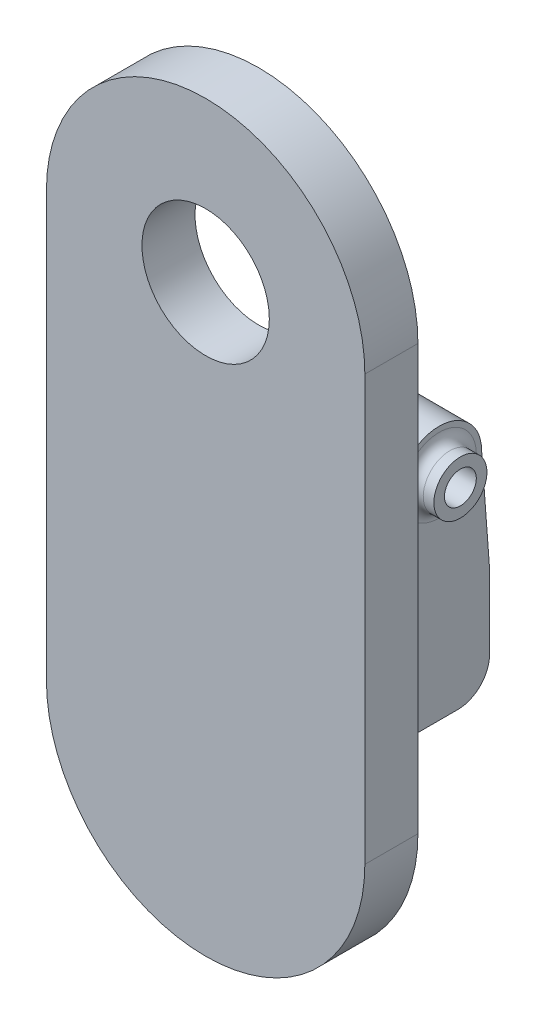
ISO-10303-21;
HEADER;
FILE_DESCRIPTION(('STEP AP214'),'2;1');
FILE_NAME('part.step','',(''),(''),'','','');
FILE_SCHEMA(('AUTOMOTIVE_DESIGN { 1 0 10303 214 1 1 1 1 }'));
ENDSEC;
DATA;
#1=APPLICATION_CONTEXT('core data for automotive mechanical design processes');
#2=APPLICATION_PROTOCOL_DEFINITION('international standard','automotive_design',2000,#1);
#3=PRODUCT_CONTEXT('',#1,'mechanical');
#4=PRODUCT('Part','Part','',(#3));
#5=PRODUCT_RELATED_PRODUCT_CATEGORY('part','',(#4));
#6=PRODUCT_DEFINITION_FORMATION('','',#4);
#7=PRODUCT_DEFINITION_CONTEXT('part definition',#1,'design');
#8=PRODUCT_DEFINITION('design','',#6,#7);
#9=PRODUCT_DEFINITION_SHAPE('','',#8);
#10=(LENGTH_UNIT() NAMED_UNIT(*) SI_UNIT(.MILLI.,.METRE.));
#11=(NAMED_UNIT(*) PLANE_ANGLE_UNIT() SI_UNIT($,.RADIAN.));
#12=(NAMED_UNIT(*) SI_UNIT($,.STERADIAN.) SOLID_ANGLE_UNIT());
#13=UNCERTAINTY_MEASURE_WITH_UNIT(LENGTH_MEASURE(1.E-05),#10,'distance_accuracy_value','');
#14=(GEOMETRIC_REPRESENTATION_CONTEXT(3) GLOBAL_UNCERTAINTY_ASSIGNED_CONTEXT((#13)) GLOBAL_UNIT_ASSIGNED_CONTEXT((#10,
#11,#12)) REPRESENTATION_CONTEXT('',''));
#15=CARTESIAN_POINT('',(0.,0.,0.));
#16=DIRECTION('',(0.,0.,1.));
#17=DIRECTION('',(1.,0.,0.));
#18=AXIS2_PLACEMENT_3D('',#15,#16,#17);
#19=CARTESIAN_POINT('',(-3.24999999999999,-40.,-25.));
#20=DIRECTION('',(-1.,0.,0.));
#21=DIRECTION('',(0.,-1.,0.));
#22=AXIS2_PLACEMENT_3D('',#19,#20,#21);
#23=PLANE('',#22);
#24=CARTESIAN_POINT('',(-3.24999999999999,-30.,-20.2500000000004));
#25=DIRECTION('',(-1.,0.,0.));
#26=DIRECTION('',(0.,-1.,0.));
#27=AXIS2_PLACEMENT_3D('',#24,#25,#26);
#28=CIRCLE('',#27,3.5);
#29=CARTESIAN_POINT('',(-3.24999999999999,-33.5,-20.2500000000004));
#30=VERTEX_POINT('',#29);
#31=EDGE_CURVE('E232',#30,#30,#28,.T.);
#32=ORIENTED_EDGE('',*,*,#31,.T.);
#33=EDGE_LOOP('',(#32));
#34=FACE_BOUND('',#33,.T.);
#35=DIRECTION('',(0.,0.,1.));
#36=VECTOR('',#35,1.);
#37=CARTESIAN_POINT('',(-3.25,-50.,-25.));
#38=LINE('',#37,#36);
#39=CARTESIAN_POINT('',(-3.25,-50.,-22.));
#40=VERTEX_POINT('',#39);
#41=CARTESIAN_POINT('',(-3.25,-50.,0.));
#42=VERTEX_POINT('',#41);
#43=EDGE_CURVE('E183',#40,#42,#38,.T.);
#44=ORIENTED_EDGE('',*,*,#43,.F.);
#45=CARTESIAN_POINT('',(-3.25,-47.,-22.));
#46=DIRECTION('',(-1.,0.,0.));
#47=DIRECTION('',(0.,-1.,0.));
#48=AXIS2_PLACEMENT_3D('',#45,#46,#47);
#49=CIRCLE('',#48,3.);
#50=CARTESIAN_POINT('',(-3.25,-47.,-25.));
#51=VERTEX_POINT('',#50);
#52=EDGE_CURVE('E244',#40,#51,#49,.F.);
#53=ORIENTED_EDGE('',*,*,#52,.T.);
#54=DIRECTION('',(0.,-1.,0.));
#55=VECTOR('',#54,1.);
#56=CARTESIAN_POINT('',(-3.24999999999999,-40.,-25.));
#57=LINE('',#56,#55);
#58=CARTESIAN_POINT('',(-3.24999999999999,-40.,-25.));
#59=VERTEX_POINT('',#58);
#60=EDGE_CURVE('E177',#59,#51,#57,.T.);
#61=ORIENTED_EDGE('',*,*,#60,.F.);
#62=DIRECTION('',(0.,0.99719930988846,0.0747899482415937));
#63=VECTOR('',#62,1.);
#64=CARTESIAN_POINT('',(-3.24999999999999,-30.,-24.2500000000004));
#65=LINE('',#64,#63);
#66=CARTESIAN_POINT('',(-3.24999999999999,-30.,-24.2500000000004));
#67=VERTEX_POINT('',#66);
#68=EDGE_CURVE('E150',#59,#67,#65,.T.);
#69=ORIENTED_EDGE('',*,*,#68,.T.);
#70=CARTESIAN_POINT('',(-3.24999999999999,-30.,-20.2500000000004));
#71=DIRECTION('',(1.,0.,0.));
#72=DIRECTION('',(0.,1.,0.));
#73=AXIS2_PLACEMENT_3D('',#70,#71,#72);
#74=CIRCLE('',#73,4.);
#75=CARTESIAN_POINT('',(-3.24999999999999,-30.,-16.2500000000004));
#76=VERTEX_POINT('',#75);
#77=EDGE_CURVE('E167',#67,#76,#74,.T.);
#78=ORIENTED_EDGE('',*,*,#77,.T.);
#79=DIRECTION('',(0.,-0.99719930988846,0.0747899482415937));
#80=VECTOR('',#79,1.);
#81=CARTESIAN_POINT('',(-3.24999999999999,-30.,-16.2500000000004));
#82=LINE('',#81,#80);
#83=CARTESIAN_POINT('',(-3.25,-37.2243698447248,-15.7081722616463));
#84=VERTEX_POINT('',#83);
#85=EDGE_CURVE('E145',#76,#84,#82,.T.);
#86=ORIENTED_EDGE('',*,*,#85,.T.);
#87=CARTESIAN_POINT('',(-3.24999999999999,-37.,-12.716574331981));
#88=DIRECTION('',(-1.,0.,0.));
#89=DIRECTION('',(0.,-1.,0.));
#90=AXIS2_PLACEMENT_3D('',#87,#88,#89);
#91=CIRCLE('',#90,3.);
#92=CARTESIAN_POINT('',(-3.24999999999999,-40.,-12.716574331981));
#93=VERTEX_POINT('',#92);
#94=EDGE_CURVE('E40',#84,#93,#91,.T.);
#95=ORIENTED_EDGE('',*,*,#94,.T.);
#96=DIRECTION('',(0.,0.,1.));
#97=VECTOR('',#96,1.);
#98=CARTESIAN_POINT('',(-3.24999999999999,-40.,-25.));
#99=LINE('',#98,#97);
#100=CARTESIAN_POINT('',(-3.24999999999999,-40.,0.));
#101=VERTEX_POINT('',#100);
#102=EDGE_CURVE('E191',#93,#101,#99,.T.);
#103=ORIENTED_EDGE('',*,*,#102,.T.);
#104=DIRECTION('',(0.,-1.,0.));
#105=VECTOR('',#104,1.);
#106=CARTESIAN_POINT('',(-3.24999999999999,-40.,0.));
#107=LINE('',#106,#105);
#108=EDGE_CURVE('E186',#101,#42,#107,.T.);
#109=ORIENTED_EDGE('',*,*,#108,.T.);
#110=EDGE_LOOP('',(#44,#53,#61,#69,#78,#86,#95,#103,#109));
#111=FACE_BOUND('',#110,.T.);
#112=ADVANCED_FACE('F32',(#34,#111),#23,.F.);
#113=CARTESIAN_POINT('',(0.,0.,0.));
#114=DIRECTION('',(0.,0.,1.));
#115=DIRECTION('',(1.,0.,0.));
#116=AXIS2_PLACEMENT_3D('',#113,#114,#115);
#117=PLANE('',#116);
#118=CARTESIAN_POINT('',(0.,0.,0.));
#119=DIRECTION('',(0.,0.,1.));
#120=DIRECTION('',(1.,0.,0.));
#121=AXIS2_PLACEMENT_3D('',#118,#119,#120);
#122=CIRCLE('',#121,15.);
#123=CARTESIAN_POINT('',(15.,0.,0.));
#124=VERTEX_POINT('',#123);
#125=CARTESIAN_POINT('',(-15.,0.,0.));
#126=VERTEX_POINT('',#125);
#127=EDGE_CURVE('E197',#124,#126,#122,.T.);
#128=ORIENTED_EDGE('',*,*,#127,.F.);
#129=DIRECTION('',(0.,1.,0.));
#130=VECTOR('',#129,1.);
#131=CARTESIAN_POINT('',(15.,0.,0.));
#132=LINE('',#131,#130);
#133=CARTESIAN_POINT('',(15.,-40.,0.));
#134=VERTEX_POINT('',#133);
#135=EDGE_CURVE('E204',#134,#124,#132,.T.);
#136=ORIENTED_EDGE('',*,*,#135,.F.);
#137=CARTESIAN_POINT('',(0.,-40.,0.));
#138=DIRECTION('',(0.,0.,1.));
#139=DIRECTION('',(1.,0.,0.));
#140=AXIS2_PLACEMENT_3D('',#137,#138,#139);
#141=CIRCLE('',#140,15.);
#142=CARTESIAN_POINT('',(-15.,-40.,0.));
#143=VERTEX_POINT('',#142);
#144=EDGE_CURVE('E215',#143,#134,#141,.T.);
#145=ORIENTED_EDGE('',*,*,#144,.F.);
#146=DIRECTION('',(0.,-1.,0.));
#147=VECTOR('',#146,1.);
#148=CARTESIAN_POINT('',(-15.,-40.,0.));
#149=LINE('',#148,#147);
#150=EDGE_CURVE('E213',#126,#143,#149,.T.);
#151=ORIENTED_EDGE('',*,*,#150,.F.);
#152=EDGE_LOOP('',(#128,#136,#145,#151));
#153=FACE_BOUND('',#152,.T.);
#154=CARTESIAN_POINT('',(0.,0.,0.));
#155=DIRECTION('',(0.,0.,1.));
#156=DIRECTION('',(1.,0.,0.));
#157=AXIS2_PLACEMENT_3D('',#154,#155,#156);
#158=CIRCLE('',#157,6.);
#159=CARTESIAN_POINT('',(6.,0.,0.));
#160=VERTEX_POINT('',#159);
#161=EDGE_CURVE('E193',#160,#160,#158,.T.);
#162=ORIENTED_EDGE('',*,*,#161,.T.);
#163=EDGE_LOOP('',(#162));
#164=FACE_BOUND('',#163,.T.);
#165=DIRECTION('',(1.,0.,0.));
#166=VECTOR('',#165,1.);
#167=CARTESIAN_POINT('',(-8.25,-40.,0.));
#168=LINE('',#167,#166);
#169=CARTESIAN_POINT('',(-10.25,-40.,0.));
#170=VERTEX_POINT('',#169);
#171=EDGE_CURVE('E172',#170,#101,#168,.T.);
#172=ORIENTED_EDGE('',*,*,#171,.F.);
#173=DIRECTION('',(0.,-1.,0.));
#174=VECTOR('',#173,1.);
#175=CARTESIAN_POINT('',(-10.25,-42.,0.));
#176=LINE('',#175,#174);
#177=CARTESIAN_POINT('',(-10.25,-50.,0.));
#178=VERTEX_POINT('',#177);
#179=EDGE_CURVE('E157',#170,#178,#176,.T.);
#180=ORIENTED_EDGE('',*,*,#179,.T.);
#181=DIRECTION('',(-1.,0.,0.));
#182=VECTOR('',#181,1.);
#183=CARTESIAN_POINT('',(-3.25,-50.,0.));
#184=LINE('',#183,#182);
#185=EDGE_CURVE('E178',#42,#178,#184,.T.);
#186=ORIENTED_EDGE('',*,*,#185,.F.);
#187=ORIENTED_EDGE('',*,*,#108,.F.);
#188=EDGE_LOOP('',(#172,#180,#186,#187));
#189=FACE_BOUND('',#188,.T.);
#190=ADVANCED_FACE('F265',(#153,#164,#189),#117,.F.);
#191=CARTESIAN_POINT('',(0.,0.,5.));
#192=DIRECTION('',(0.,0.,1.));
#193=DIRECTION('',(1.,0.,0.));
#194=AXIS2_PLACEMENT_3D('',#191,#192,#193);
#195=PLANE('',#194);
#196=CARTESIAN_POINT('',(0.,0.,5.));
#197=DIRECTION('',(0.,0.,1.));
#198=DIRECTION('',(1.,0.,0.));
#199=AXIS2_PLACEMENT_3D('',#196,#197,#198);
#200=CIRCLE('',#199,15.);
#201=CARTESIAN_POINT('',(15.,0.,5.));
#202=VERTEX_POINT('',#201);
#203=CARTESIAN_POINT('',(-15.,0.,5.));
#204=VERTEX_POINT('',#203);
#205=EDGE_CURVE('E200',#202,#204,#200,.T.);
#206=ORIENTED_EDGE('',*,*,#205,.T.);
#207=DIRECTION('',(0.,-1.,0.));
#208=VECTOR('',#207,1.);
#209=CARTESIAN_POINT('',(-15.,-40.,5.));
#210=LINE('',#209,#208);
#211=CARTESIAN_POINT('',(-15.,-40.,5.));
#212=VERTEX_POINT('',#211);
#213=EDGE_CURVE('E203',#204,#212,#210,.T.);
#214=ORIENTED_EDGE('',*,*,#213,.T.);
#215=CARTESIAN_POINT('',(0.,-40.,5.));
#216=DIRECTION('',(0.,0.,1.));
#217=DIRECTION('',(1.,0.,0.));
#218=AXIS2_PLACEMENT_3D('',#215,#216,#217);
#219=CIRCLE('',#218,15.);
#220=CARTESIAN_POINT('',(15.,-40.,5.));
#221=VERTEX_POINT('',#220);
#222=EDGE_CURVE('E206',#212,#221,#219,.T.);
#223=ORIENTED_EDGE('',*,*,#222,.T.);
#224=DIRECTION('',(0.,1.,0.));
#225=VECTOR('',#224,1.);
#226=CARTESIAN_POINT('',(15.,0.,5.));
#227=LINE('',#226,#225);
#228=EDGE_CURVE('E208',#221,#202,#227,.T.);
#229=ORIENTED_EDGE('',*,*,#228,.T.);
#230=EDGE_LOOP('',(#206,#214,#223,#229));
#231=FACE_BOUND('',#230,.T.);
#232=CARTESIAN_POINT('',(0.,0.,5.));
#233=DIRECTION('',(0.,0.,1.));
#234=DIRECTION('',(1.,0.,0.));
#235=AXIS2_PLACEMENT_3D('',#232,#233,#234);
#236=CIRCLE('',#235,6.);
#237=CARTESIAN_POINT('',(6.,0.,5.));
#238=VERTEX_POINT('',#237);
#239=EDGE_CURVE('E194',#238,#238,#236,.T.);
#240=ORIENTED_EDGE('',*,*,#239,.F.);
#241=EDGE_LOOP('',(#240));
#242=FACE_BOUND('',#241,.T.);
#243=ADVANCED_FACE('F271',(#231,#242),#195,.T.);
#244=CARTESIAN_POINT('',(0.,0.,5.));
#245=DIRECTION('',(0.,0.,-1.));
#246=DIRECTION('',(-1.,0.,0.));
#247=AXIS2_PLACEMENT_3D('',#244,#245,#246);
#248=CYLINDRICAL_SURFACE('',#247,15.);
#249=ORIENTED_EDGE('',*,*,#127,.T.);
#250=DIRECTION('',(0.,0.,-1.));
#251=VECTOR('',#250,1.);
#252=CARTESIAN_POINT('',(-15.,0.,5.));
#253=LINE('',#252,#251);
#254=EDGE_CURVE('E226',#204,#126,#253,.T.);
#255=ORIENTED_EDGE('',*,*,#254,.F.);
#256=ORIENTED_EDGE('',*,*,#205,.F.);
#257=DIRECTION('',(0.,0.,-1.));
#258=VECTOR('',#257,1.);
#259=CARTESIAN_POINT('',(15.,0.,5.));
#260=LINE('',#259,#258);
#261=EDGE_CURVE('E210',#202,#124,#260,.T.);
#262=ORIENTED_EDGE('',*,*,#261,.T.);
#263=EDGE_LOOP('',(#249,#255,#256,#262));
#264=FACE_BOUND('',#263,.T.);
#265=ADVANCED_FACE('F286',(#264),#248,.T.);
#266=CARTESIAN_POINT('',(-15.,-40.,5.));
#267=DIRECTION('',(1.,0.,0.));
#268=DIRECTION('',(0.,0.,-1.));
#269=AXIS2_PLACEMENT_3D('',#266,#267,#268);
#270=PLANE('',#269);
#271=ORIENTED_EDGE('',*,*,#150,.T.);
#272=DIRECTION('',(0.,0.,-1.));
#273=VECTOR('',#272,1.);
#274=CARTESIAN_POINT('',(-15.,-40.,5.));
#275=LINE('',#274,#273);
#276=EDGE_CURVE('E223',#212,#143,#275,.T.);
#277=ORIENTED_EDGE('',*,*,#276,.F.);
#278=ORIENTED_EDGE('',*,*,#213,.F.);
#279=ORIENTED_EDGE('',*,*,#254,.T.);
#280=EDGE_LOOP('',(#271,#277,#278,#279));
#281=FACE_BOUND('',#280,.T.);
#282=ADVANCED_FACE('F295',(#281),#270,.F.);
#283=CARTESIAN_POINT('',(0.,-40.,5.));
#284=DIRECTION('',(0.,0.,-1.));
#285=DIRECTION('',(-1.,0.,0.));
#286=AXIS2_PLACEMENT_3D('',#283,#284,#285);
#287=CYLINDRICAL_SURFACE('',#286,15.);
#288=ORIENTED_EDGE('',*,*,#144,.T.);
#289=DIRECTION('',(0.,0.,-1.));
#290=VECTOR('',#289,1.);
#291=CARTESIAN_POINT('',(15.,-40.,5.));
#292=LINE('',#291,#290);
#293=EDGE_CURVE('E220',#221,#134,#292,.T.);
#294=ORIENTED_EDGE('',*,*,#293,.F.);
#295=ORIENTED_EDGE('',*,*,#222,.F.);
#296=ORIENTED_EDGE('',*,*,#276,.T.);
#297=EDGE_LOOP('',(#288,#294,#295,#296));
#298=FACE_BOUND('',#297,.T.);
#299=ADVANCED_FACE('F291',(#298),#287,.T.);
#300=CARTESIAN_POINT('',(15.,0.,5.));
#301=DIRECTION('',(-1.,0.,0.));
#302=DIRECTION('',(0.,0.,1.));
#303=AXIS2_PLACEMENT_3D('',#300,#301,#302);
#304=PLANE('',#303);
#305=ORIENTED_EDGE('',*,*,#135,.T.);
#306=ORIENTED_EDGE('',*,*,#261,.F.);
#307=ORIENTED_EDGE('',*,*,#228,.F.);
#308=ORIENTED_EDGE('',*,*,#293,.T.);
#309=EDGE_LOOP('',(#305,#306,#307,#308));
#310=FACE_BOUND('',#309,.T.);
#311=ADVANCED_FACE('F283',(#310),#304,.F.);
#312=CARTESIAN_POINT('',(0.,0.,5.));
#313=DIRECTION('',(0.,0.,-1.));
#314=DIRECTION('',(-1.,0.,0.));
#315=AXIS2_PLACEMENT_3D('',#312,#313,#314);
#316=CYLINDRICAL_SURFACE('',#315,6.);
#317=ORIENTED_EDGE('',*,*,#239,.T.);
#318=EDGE_LOOP('',(#317));
#319=FACE_BOUND('',#318,.T.);
#320=ORIENTED_EDGE('',*,*,#161,.F.);
#321=EDGE_LOOP('',(#320));
#322=FACE_BOUND('',#321,.T.);
#323=ADVANCED_FACE('F280',(#319,#322),#316,.F.);
#324=CARTESIAN_POINT('',(-8.25,-40.,-25.));
#325=DIRECTION('',(0.,-1.,0.));
#326=DIRECTION('',(0.,0.,-1.));
#327=AXIS2_PLACEMENT_3D('',#324,#325,#326);
#328=PLANE('',#327);
#329=ORIENTED_EDGE('',*,*,#102,.F.);
#330=DIRECTION('',(1.,0.,0.));
#331=VECTOR('',#330,1.);
#332=CARTESIAN_POINT('',(-8.25,-40.,-12.716574331981));
#333=LINE('',#332,#331);
#334=CARTESIAN_POINT('',(-9.23267405344151,-40.,-12.716574331981));
#335=VERTEX_POINT('',#334);
#336=EDGE_CURVE('E237',#93,#335,#333,.F.);
#337=ORIENTED_EDGE('',*,*,#336,.T.);
#338=DIRECTION('',(0.07974522228289,0.,-0.996815278536125));
#339=VECTOR('',#338,1.);
#340=CARTESIAN_POINT('',(-10.4326967189007,-40.,2.28370898625924));
#341=LINE('',#340,#339);
#342=EDGE_CURVE('E138',#170,#335,#341,.T.);
#343=ORIENTED_EDGE('',*,*,#342,.F.);
#344=ORIENTED_EDGE('',*,*,#171,.T.);
#345=EDGE_LOOP('',(#329,#337,#343,#344));
#346=FACE_BOUND('',#345,.T.);
#347=ADVANCED_FACE('F251',(#346),#328,.F.);
#348=CARTESIAN_POINT('',(-3.25,-50.,-25.));
#349=DIRECTION('',(0.,1.,0.));
#350=DIRECTION('',(0.,0.,1.));
#351=AXIS2_PLACEMENT_3D('',#348,#349,#350);
#352=PLANE('',#351);
#353=DIRECTION('',(0.07974522228289,0.,-0.996815278536125));
#354=VECTOR('',#353,1.);
#355=CARTESIAN_POINT('',(-10.25,-50.,0.));
#356=LINE('',#355,#354);
#357=CARTESIAN_POINT('',(-8.49,-50.,-22.));
#358=VERTEX_POINT('',#357);
#359=EDGE_CURVE('E154',#178,#358,#356,.T.);
#360=ORIENTED_EDGE('',*,*,#359,.T.);
#361=DIRECTION('',(-1.,0.,0.));
#362=VECTOR('',#361,1.);
#363=CARTESIAN_POINT('',(-3.25,-50.,-22.));
#364=LINE('',#363,#362);
#365=EDGE_CURVE('E47',#358,#40,#364,.F.);
#366=ORIENTED_EDGE('',*,*,#365,.T.);
#367=ORIENTED_EDGE('',*,*,#43,.T.);
#368=ORIENTED_EDGE('',*,*,#185,.T.);
#369=EDGE_LOOP('',(#360,#366,#367,#368));
#370=FACE_BOUND('',#369,.T.);
#371=ADVANCED_FACE('F276',(#370),#352,.F.);
#372=CARTESIAN_POINT('',(0.,0.,-25.));
#373=DIRECTION('',(0.,0.,-1.));
#374=DIRECTION('',(-1.,0.,0.));
#375=AXIS2_PLACEMENT_3D('',#372,#373,#374);
#376=PLANE('',#375);
#377=ORIENTED_EDGE('',*,*,#60,.T.);
#378=DIRECTION('',(-1.,0.,0.));
#379=VECTOR('',#378,1.);
#380=CARTESIAN_POINT('',(-8.24999999999999,-47.,-25.));
#381=LINE('',#380,#379);
#382=CARTESIAN_POINT('',(-8.24999999999999,-47.,-25.));
#383=VERTEX_POINT('',#382);
#384=EDGE_CURVE('E239',#51,#383,#381,.T.);
#385=ORIENTED_EDGE('',*,*,#384,.T.);
#386=DIRECTION('',(0.,1.,0.));
#387=VECTOR('',#386,1.);
#388=CARTESIAN_POINT('',(-8.24999999999999,-50.,-25.));
#389=LINE('',#388,#387);
#390=CARTESIAN_POINT('',(-8.24999999999999,-40.,-25.));
#391=VERTEX_POINT('',#390);
#392=EDGE_CURVE('E181',#383,#391,#389,.T.);
#393=ORIENTED_EDGE('',*,*,#392,.T.);
#394=DIRECTION('',(1.,0.,0.));
#395=VECTOR('',#394,1.);
#396=CARTESIAN_POINT('',(-8.25,-40.,-25.));
#397=LINE('',#396,#395);
#398=EDGE_CURVE('E174',#391,#59,#397,.T.);
#399=ORIENTED_EDGE('',*,*,#398,.T.);
#400=EDGE_LOOP('',(#377,#385,#393,#399));
#401=FACE_BOUND('',#400,.T.);
#402=ADVANCED_FACE('F353',(#401),#376,.T.);
#403=CARTESIAN_POINT('',(-8.24999999999999,-30.,-20.2500000000004));
#404=DIRECTION('',(1.,0.,0.));
#405=DIRECTION('',(0.,1.,0.));
#406=AXIS2_PLACEMENT_3D('',#403,#404,#405);
#407=CYLINDRICAL_SURFACE('',#406,4.);
#408=ORIENTED_EDGE('',*,*,#77,.F.);
#409=DIRECTION('',(1.,0.,0.));
#410=VECTOR('',#409,1.);
#411=CARTESIAN_POINT('',(-8.24999999999999,-30.,-24.2500000000004));
#412=LINE('',#411,#410);
#413=CARTESIAN_POINT('',(-8.30999999999996,-30.,-24.2500000000004));
#414=VERTEX_POINT('',#413);
#415=EDGE_CURVE('E149',#414,#67,#412,.T.);
#416=ORIENTED_EDGE('',*,*,#415,.F.);
#417=CARTESIAN_POINT('',(-8.62999999999996,-30.,-20.2500000000004));
#418=DIRECTION('',(-0.996815278536125,0.,-0.07974522228289));
#419=DIRECTION('',(0.07974522228289,0.,-0.996815278536125));
#420=AXIS2_PLACEMENT_3D('',#417,#418,#419);
#421=ELLIPSE('',#420,4.01277958527502,4.);
#422=CARTESIAN_POINT('',(-8.94999999999996,-30.,-16.2500000000004));
#423=VERTEX_POINT('',#422);
#424=EDGE_CURVE('E132',#423,#414,#421,.T.);
#425=ORIENTED_EDGE('',*,*,#424,.F.);
#426=DIRECTION('',(1.,0.,0.));
#427=VECTOR('',#426,1.);
#428=CARTESIAN_POINT('',(-8.24999999999999,-30.,-16.2500000000004));
#429=LINE('',#428,#427);
#430=EDGE_CURVE('E142',#423,#76,#429,.T.);
#431=ORIENTED_EDGE('',*,*,#430,.T.);
#432=EDGE_LOOP('',(#408,#416,#425,#431));
#433=FACE_BOUND('',#432,.T.);
#434=ADVANCED_FACE('F152',(#433),#407,.T.);
#435=CARTESIAN_POINT('',(-8.24999999999999,-30.,-24.2500000000004));
#436=DIRECTION('',(0.,0.0747899482415937,-0.99719930988846));
#437=DIRECTION('',(0.,0.99719930988846,0.0747899482415937));
#438=AXIS2_PLACEMENT_3D('',#435,#436,#437);
#439=PLANE('',#438);
#440=ORIENTED_EDGE('',*,*,#68,.F.);
#441=ORIENTED_EDGE('',*,*,#398,.F.);
#442=DIRECTION('',(0.00598308876708736,-0.99718146118177,-0.074788609588592));
#443=VECTOR('',#442,1.);
#444=CARTESIAN_POINT('',(-8.31109787107749,-29.8170214870789,-24.2362766115313));
#445=LINE('',#444,#443);
#446=EDGE_CURVE('E155',#414,#391,#445,.T.);
#447=ORIENTED_EDGE('',*,*,#446,.F.);
#448=ORIENTED_EDGE('',*,*,#415,.T.);
#449=EDGE_LOOP('',(#440,#441,#447,#448));
#450=FACE_BOUND('',#449,.T.);
#451=ADVANCED_FACE('F346',(#450),#439,.T.);
#452=CARTESIAN_POINT('',(-8.24999999999999,-30.,-16.2500000000004));
#453=DIRECTION('',(0.,0.0747899482415937,0.99719930988846));
#454=DIRECTION('',(0.,-0.99719930988846,0.0747899482415937));
#455=AXIS2_PLACEMENT_3D('',#452,#453,#454);
#456=PLANE('',#455);
#457=DIRECTION('',(0.00598308876708736,0.99718146118177,-0.074788609588592));
#458=VECTOR('',#457,1.);
#459=CARTESIAN_POINT('',(-9.01107281293162,-40.1788021552817,-15.4865898383547));
#460=LINE('',#459,#458);
#461=CARTESIAN_POINT('',(-8.99334621906828,-37.2243698447248,-15.7081722616463));
#462=VERTEX_POINT('',#461);
#463=EDGE_CURVE('E126',#462,#423,#460,.T.);
#464=ORIENTED_EDGE('',*,*,#463,.F.);
#465=DIRECTION('',(1.,0.,0.));
#466=VECTOR('',#465,1.);
#467=CARTESIAN_POINT('',(-8.24999999999999,-37.2243698447248,-15.7081722616463));
#468=LINE('',#467,#466);
#469=EDGE_CURVE('E235',#462,#84,#468,.T.);
#470=ORIENTED_EDGE('',*,*,#469,.T.);
#471=ORIENTED_EDGE('',*,*,#85,.F.);
#472=ORIENTED_EDGE('',*,*,#430,.F.);
#473=EDGE_LOOP('',(#464,#470,#471,#472));
#474=FACE_BOUND('',#473,.T.);
#475=ADVANCED_FACE('F143',(#474),#456,.T.);
#476=CARTESIAN_POINT('',(-8.24999999999999,-30.,-20.2500000000004));
#477=DIRECTION('',(1.,0.,0.));
#478=DIRECTION('',(0.,1.,0.));
#479=AXIS2_PLACEMENT_3D('',#476,#477,#478);
#480=CYLINDRICAL_SURFACE('',#479,1.5);
#481=CARTESIAN_POINT('',(-8.62999999999996,-30.,-20.2500000000004));
#482=DIRECTION('',(-0.996815278536125,0.,-0.07974522228289));
#483=DIRECTION('',(0.07974522228289,0.,-0.996815278536125));
#484=AXIS2_PLACEMENT_3D('',#481,#482,#483);
#485=ELLIPSE('',#484,1.50479234447814,1.5);
#486=CARTESIAN_POINT('',(-8.50999999999996,-30.,-21.7500000000004));
#487=VERTEX_POINT('',#486);
#488=EDGE_CURVE('E139',#487,#487,#485,.T.);
#489=ORIENTED_EDGE('',*,*,#488,.T.);
#490=EDGE_LOOP('',(#489));
#491=FACE_BOUND('',#490,.T.);
#492=CARTESIAN_POINT('',(-1.24999999999999,-30.,-20.2500000000004));
#493=DIRECTION('',(1.,0.,0.));
#494=DIRECTION('',(0.,1.,0.));
#495=AXIS2_PLACEMENT_3D('',#492,#493,#494);
#496=CIRCLE('',#495,1.5);
#497=CARTESIAN_POINT('',(-1.24999999999999,-28.5,-20.2500000000004));
#498=VERTEX_POINT('',#497);
#499=EDGE_CURVE('E325',#498,#498,#496,.T.);
#500=ORIENTED_EDGE('',*,*,#499,.T.);
#501=EDGE_LOOP('',(#500));
#502=FACE_BOUND('',#501,.T.);
#503=ADVANCED_FACE('F329',(#491,#502),#480,.F.);
#504=CARTESIAN_POINT('',(-10.25,-42.,0.));
#505=DIRECTION('',(-0.996815278536125,0.,-0.07974522228289));
#506=DIRECTION('',(-0.07974522228289,0.,0.996815278536125));
#507=AXIS2_PLACEMENT_3D('',#504,#505,#506);
#508=PLANE('',#507);
#509=ORIENTED_EDGE('',*,*,#392,.F.);
#510=CARTESIAN_POINT('',(-8.48999999999999,-47.,-22.));
#511=DIRECTION('',(-0.996815278536125,0.,-0.07974522228289));
#512=DIRECTION('',(0.07974522228289,0.,-0.996815278536125));
#513=AXIS2_PLACEMENT_3D('',#510,#511,#512);
#514=ELLIPSE('',#513,3.00958468895627,3.);
#515=EDGE_CURVE('E55',#383,#358,#514,.T.);
#516=ORIENTED_EDGE('',*,*,#515,.T.);
#517=ORIENTED_EDGE('',*,*,#359,.F.);
#518=ORIENTED_EDGE('',*,*,#179,.F.);
#519=ORIENTED_EDGE('',*,*,#342,.T.);
#520=CARTESIAN_POINT('',(-9.23267405344152,-37.,-12.716574331981));
#521=DIRECTION('',(-0.996815278536125,0.,-0.07974522228289));
#522=DIRECTION('',(0.07974522228289,0.,-0.996815278536125));
#523=AXIS2_PLACEMENT_3D('',#520,#521,#522);
#524=ELLIPSE('',#523,3.00958468895627,3.);
#525=EDGE_CURVE('E11',#335,#462,#524,.F.);
#526=ORIENTED_EDGE('',*,*,#525,.T.);
#527=ORIENTED_EDGE('',*,*,#463,.T.);
#528=ORIENTED_EDGE('',*,*,#424,.T.);
#529=ORIENTED_EDGE('',*,*,#446,.T.);
#530=EDGE_LOOP('',(#509,#516,#517,#518,#519,#526,#527,#528,#529));
#531=FACE_BOUND('',#530,.T.);
#532=ORIENTED_EDGE('',*,*,#488,.F.);
#533=EDGE_LOOP('',(#532));
#534=FACE_BOUND('',#533,.T.);
#535=ADVANCED_FACE('F128',(#531,#534),#508,.T.);
#536=CARTESIAN_POINT('',(-1.24999999999999,-30.,-20.2500000000004));
#537=DIRECTION('',(1.,0.,0.));
#538=DIRECTION('',(0.,1.,0.));
#539=AXIS2_PLACEMENT_3D('',#536,#537,#538);
#540=PLANE('',#539);
#541=CARTESIAN_POINT('',(-1.24999999999999,-30.,-20.2500000000004));
#542=DIRECTION('',(1.,0.,0.));
#543=DIRECTION('',(0.,1.,0.));
#544=AXIS2_PLACEMENT_3D('',#541,#542,#543);
#545=CIRCLE('',#544,2.5);
#546=CARTESIAN_POINT('',(-1.24999999999999,-27.5,-20.2500000000004));
#547=VERTEX_POINT('',#546);
#548=EDGE_CURVE('E163',#547,#547,#545,.T.);
#549=ORIENTED_EDGE('',*,*,#548,.T.);
#550=EDGE_LOOP('',(#549));
#551=FACE_BOUND('',#550,.T.);
#552=ORIENTED_EDGE('',*,*,#499,.F.);
#553=EDGE_LOOP('',(#552));
#554=FACE_BOUND('',#553,.T.);
#555=ADVANCED_FACE('F331',(#551,#554),#540,.T.);
#556=CARTESIAN_POINT('',(-1.24999999999999,-30.,-20.2500000000004));
#557=DIRECTION('',(-1.,0.,0.));
#558=DIRECTION('',(0.,-1.,0.));
#559=AXIS2_PLACEMENT_3D('',#556,#557,#558);
#560=CYLINDRICAL_SURFACE('',#559,2.5);
#561=CARTESIAN_POINT('',(-2.24999999999999,-30.,-20.2500000000004));
#562=DIRECTION('',(-1.,0.,0.));
#563=DIRECTION('',(0.,-1.,0.));
#564=AXIS2_PLACEMENT_3D('',#561,#562,#563);
#565=CIRCLE('',#564,2.5);
#566=CARTESIAN_POINT('',(-2.24999999999999,-32.5,-20.2500000000004));
#567=VERTEX_POINT('',#566);
#568=EDGE_CURVE('E229',#567,#567,#565,.F.);
#569=ORIENTED_EDGE('',*,*,#568,.T.);
#570=EDGE_LOOP('',(#569));
#571=FACE_BOUND('',#570,.T.);
#572=ORIENTED_EDGE('',*,*,#548,.F.);
#573=EDGE_LOOP('',(#572));
#574=FACE_BOUND('',#573,.T.);
#575=ADVANCED_FACE('F261',(#571,#574),#560,.T.);
#576=CARTESIAN_POINT('',(-2.24999999999999,-30.,-20.2500000000004));
#577=DIRECTION('',(-1.,0.,0.));
#578=DIRECTION('',(0.,-1.,0.));
#579=AXIS2_PLACEMENT_3D('',#576,#577,#578);
#580=TOROIDAL_SURFACE('',#579,3.5,1.);
#581=ORIENTED_EDGE('',*,*,#31,.F.);
#582=EDGE_LOOP('',(#581));
#583=FACE_BOUND('',#582,.T.);
#584=ORIENTED_EDGE('',*,*,#568,.F.);
#585=EDGE_LOOP('',(#584));
#586=FACE_BOUND('',#585,.T.);
#587=ADVANCED_FACE('F255',(#583,#586),#580,.F.);
#588=CARTESIAN_POINT('',(-8.24999999999999,-37.,-12.716574331981));
#589=DIRECTION('',(1.,0.,0.));
#590=DIRECTION('',(0.,0.,-1.));
#591=AXIS2_PLACEMENT_3D('',#588,#589,#590);
#592=CYLINDRICAL_SURFACE('',#591,3.);
#593=ORIENTED_EDGE('',*,*,#525,.F.);
#594=ORIENTED_EDGE('',*,*,#336,.F.);
#595=ORIENTED_EDGE('',*,*,#94,.F.);
#596=ORIENTED_EDGE('',*,*,#469,.F.);
#597=EDGE_LOOP('',(#593,#594,#595,#596));
#598=FACE_BOUND('',#597,.T.);
#599=ADVANCED_FACE('F253',(#598),#592,.F.);
#600=CARTESIAN_POINT('',(0.,-47.,-22.));
#601=DIRECTION('',(1.,0.,0.));
#602=DIRECTION('',(0.,0.,-1.));
#603=AXIS2_PLACEMENT_3D('',#600,#601,#602);
#604=CYLINDRICAL_SURFACE('',#603,3.);
#605=ORIENTED_EDGE('',*,*,#52,.F.);
#606=ORIENTED_EDGE('',*,*,#365,.F.);
#607=ORIENTED_EDGE('',*,*,#515,.F.);
#608=ORIENTED_EDGE('',*,*,#384,.F.);
#609=EDGE_LOOP('',(#605,#606,#607,#608));
#610=FACE_BOUND('',#609,.T.);
#611=ADVANCED_FACE('F34',(#610),#604,.T.);
#612=CLOSED_SHELL('',(#112,#190,#243,#265,#282,#299,#311,#323,#347,#371,#402,#434,#451,#475,
#503,#535,#555,#575,#587,#599,#611));
#613=MANIFOLD_SOLID_BREP('B2',#612);
#614=ADVANCED_BREP_SHAPE_REPRESENTATION('',(#18,#613),#14);
#615=SHAPE_DEFINITION_REPRESENTATION(#9,#614);
ENDSEC;
END-ISO-10303-21;
